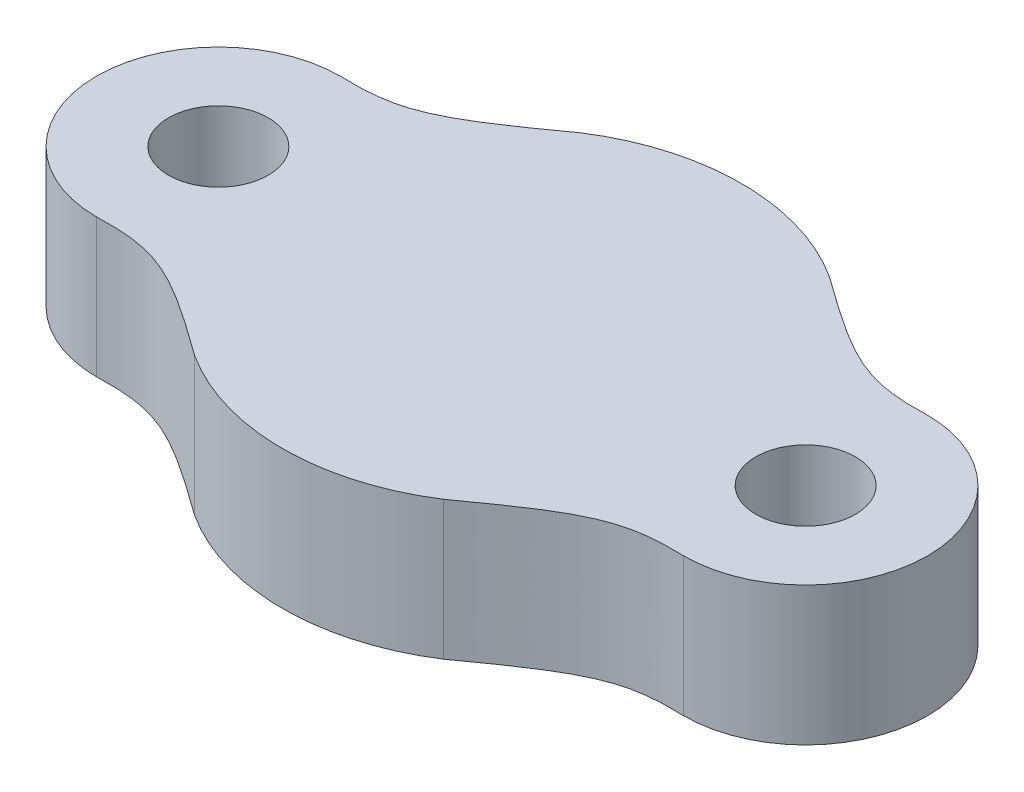
ISO-10303-21;
HEADER;
FILE_DESCRIPTION(('STEP AP214'),'2;1');
FILE_NAME('part.step','',(''),(''),'','','');
FILE_SCHEMA(('AUTOMOTIVE_DESIGN { 1 0 10303 214 1 1 1 1 }'));
ENDSEC;
DATA;
#1=APPLICATION_CONTEXT('core data for automotive mechanical design processes');
#2=APPLICATION_PROTOCOL_DEFINITION('international standard','automotive_design',2000,#1);
#3=PRODUCT_CONTEXT('',#1,'mechanical');
#4=PRODUCT('Part','Part','',(#3));
#5=PRODUCT_RELATED_PRODUCT_CATEGORY('part','',(#4));
#6=PRODUCT_DEFINITION_FORMATION('','',#4);
#7=PRODUCT_DEFINITION_CONTEXT('part definition',#1,'design');
#8=PRODUCT_DEFINITION('design','',#6,#7);
#9=PRODUCT_DEFINITION_SHAPE('','',#8);
#10=(LENGTH_UNIT() NAMED_UNIT(*) SI_UNIT(.MILLI.,.METRE.));
#11=(NAMED_UNIT(*) PLANE_ANGLE_UNIT() SI_UNIT($,.RADIAN.));
#12=(NAMED_UNIT(*) SI_UNIT($,.STERADIAN.) SOLID_ANGLE_UNIT());
#13=UNCERTAINTY_MEASURE_WITH_UNIT(LENGTH_MEASURE(1.E-05),#10,'distance_accuracy_value','');
#14=(GEOMETRIC_REPRESENTATION_CONTEXT(3) GLOBAL_UNCERTAINTY_ASSIGNED_CONTEXT((#13)) GLOBAL_UNIT_ASSIGNED_CONTEXT((#10,
#11,#12)) REPRESENTATION_CONTEXT('',''));
#15=CARTESIAN_POINT('',(0.,0.,0.));
#16=DIRECTION('',(0.,0.,1.));
#17=DIRECTION('',(1.,0.,0.));
#18=AXIS2_PLACEMENT_3D('',#15,#16,#17);
#19=CARTESIAN_POINT('',(-3.38919999851041,3.175,-1.4762849629327));
#20=DIRECTION('',(0.,-1.,0.));
#21=DIRECTION('',(0.,0.,-1.));
#22=AXIS2_PLACEMENT_3D('',#19,#20,#21);
#23=CYLINDRICAL_SURFACE('',#22,2.794);
#24=CARTESIAN_POINT('',(-3.38919999851041,0.,-1.4762849629327));
#25=DIRECTION('',(0.,1.,0.));
#26=DIRECTION('',(0.,0.,1.));
#27=AXIS2_PLACEMENT_3D('',#24,#25,#26);
#28=CIRCLE('',#27,2.794);
#29=CARTESIAN_POINT('',(-3.38919999851041,0.,-4.27028496293271));
#30=VERTEX_POINT('',#29);
#31=CARTESIAN_POINT('',(-3.38919999851041,0.,1.3177150370673));
#32=VERTEX_POINT('',#31);
#33=EDGE_CURVE('E204',#30,#32,#28,.F.);
#34=ORIENTED_EDGE('',*,*,#33,.F.);
#35=DIRECTION('',(0.,-1.,0.));
#36=VECTOR('',#35,1.);
#37=CARTESIAN_POINT('',(-3.38919999851041,3.175,-4.27028496293271));
#38=LINE('',#37,#36);
#39=CARTESIAN_POINT('',(-3.38919999851041,3.175,-4.27028496293271));
#40=VERTEX_POINT('',#39);
#41=EDGE_CURVE('E11',#40,#30,#38,.T.);
#42=ORIENTED_EDGE('',*,*,#41,.F.);
#43=CARTESIAN_POINT('',(-3.38919999851041,3.175,-1.4762849629327));
#44=DIRECTION('',(0.,1.,0.));
#45=DIRECTION('',(0.,0.,1.));
#46=AXIS2_PLACEMENT_3D('',#43,#44,#45);
#47=CIRCLE('',#46,2.794);
#48=CARTESIAN_POINT('',(-3.38919999851041,3.175,1.3177150370673));
#49=VERTEX_POINT('',#48);
#50=EDGE_CURVE('E141',#40,#49,#47,.F.);
#51=ORIENTED_EDGE('',*,*,#50,.T.);
#52=DIRECTION('',(0.,-1.,0.));
#53=VECTOR('',#52,1.);
#54=CARTESIAN_POINT('',(-3.38919999851041,3.175,1.3177150370673));
#55=LINE('',#54,#53);
#56=EDGE_CURVE('E55',#49,#32,#55,.T.);
#57=ORIENTED_EDGE('',*,*,#56,.T.);
#58=EDGE_LOOP('',(#34,#42,#51,#57));
#59=FACE_BOUND('',#58,.T.);
#60=ADVANCED_FACE('F39',(#59),#23,.T.);
#61=CARTESIAN_POINT('',(-3.38919999851041,3.175,-4.2702849629327));
#62=CARTESIAN_POINT('',(-4.78955958875303,3.175,-4.22149581850878));
#63=CARTESIAN_POINT('',(-5.3630765743595,3.175,-4.51950990375443));
#64=CARTESIAN_POINT('',(-7.2652862285684,3.175,-5.89707376315778));
#65=B_SPLINE_CURVE_WITH_KNOTS('',3,(#61,#62,#63,#64),.UNSPECIFIED.,.F.,.F.,(4,4),(0.,1.),.UNSPECIFIED.);
#66=DIRECTION('',(0.,-1.,0.));
#67=VECTOR('',#66,1.);
#68=SURFACE_OF_LINEAR_EXTRUSION('',#65,#67);
#69=CARTESIAN_POINT('',(-3.38919999851041,0.,-4.2702849629327));
#70=CARTESIAN_POINT('',(-4.78955958875303,0.,-4.22149581850878));
#71=CARTESIAN_POINT('',(-5.3630765743595,0.,-4.51950990375443));
#72=CARTESIAN_POINT('',(-7.2652862285684,0.,-5.89707376315778));
#73=B_SPLINE_CURVE_WITH_KNOTS('',3,(#69,#70,#71,#72),.UNSPECIFIED.,.F.,.F.,(4,4),(0.,1.),.UNSPECIFIED.);
#74=CARTESIAN_POINT('',(-7.2652862285684,0.,-5.89707376315778));
#75=VERTEX_POINT('',#74);
#76=EDGE_CURVE('E207',#30,#75,#73,.T.);
#77=ORIENTED_EDGE('',*,*,#76,.T.);
#78=DIRECTION('',(0.,-1.,0.));
#79=VECTOR('',#78,1.);
#80=CARTESIAN_POINT('',(-7.2652862285684,3.175,-5.89707376315778));
#81=LINE('',#80,#79);
#82=CARTESIAN_POINT('',(-7.2652862285684,3.175,-5.89707376315778));
#83=VERTEX_POINT('',#82);
#84=EDGE_CURVE('E47',#83,#75,#81,.T.);
#85=ORIENTED_EDGE('',*,*,#84,.F.);
#86=EDGE_CURVE('E137',#40,#83,#65,.T.);
#87=ORIENTED_EDGE('',*,*,#86,.F.);
#88=ORIENTED_EDGE('',*,*,#41,.T.);
#89=EDGE_LOOP('',(#77,#85,#87,#88));
#90=FACE_BOUND('',#89,.T.);
#91=ADVANCED_FACE('F151',(#90),#68,.F.);
#92=CARTESIAN_POINT('',(-10.1201999985104,3.175,-1.4762849629327));
#93=DIRECTION('',(0.,-1.,0.));
#94=DIRECTION('',(0.,0.,-1.));
#95=AXIS2_PLACEMENT_3D('',#92,#93,#94);
#96=CYLINDRICAL_SURFACE('',#95,5.2625);
#97=CARTESIAN_POINT('',(-10.1201999985104,0.,-1.4762849629327));
#98=DIRECTION('',(0.,1.,0.));
#99=DIRECTION('',(0.,0.,1.));
#100=AXIS2_PLACEMENT_3D('',#97,#98,#99);
#101=CIRCLE('',#100,5.2625);
#102=CARTESIAN_POINT('',(-12.9751137684524,0.,-5.89707376315778));
#103=VERTEX_POINT('',#102);
#104=EDGE_CURVE('E209',#75,#103,#101,.T.);
#105=ORIENTED_EDGE('',*,*,#104,.T.);
#106=DIRECTION('',(0.,-1.,0.));
#107=VECTOR('',#106,1.);
#108=CARTESIAN_POINT('',(-12.9751137684524,3.175,-5.89707376315778));
#109=LINE('',#108,#107);
#110=CARTESIAN_POINT('',(-12.9751137684524,3.175,-5.89707376315778));
#111=VERTEX_POINT('',#110);
#112=EDGE_CURVE('E256',#111,#103,#109,.T.);
#113=ORIENTED_EDGE('',*,*,#112,.F.);
#114=CARTESIAN_POINT('',(-10.1201999985104,3.175,-1.4762849629327));
#115=DIRECTION('',(0.,1.,0.));
#116=DIRECTION('',(0.,0.,1.));
#117=AXIS2_PLACEMENT_3D('',#114,#115,#116);
#118=CIRCLE('',#117,5.2625);
#119=EDGE_CURVE('E131',#83,#111,#118,.T.);
#120=ORIENTED_EDGE('',*,*,#119,.F.);
#121=ORIENTED_EDGE('',*,*,#84,.T.);
#122=EDGE_LOOP('',(#105,#113,#120,#121));
#123=FACE_BOUND('',#122,.T.);
#124=ADVANCED_FACE('F154',(#123),#96,.T.);
#125=CARTESIAN_POINT('',(-16.8511999985104,3.175,-4.2702849629327));
#126=CARTESIAN_POINT('',(-15.4508404082678,3.175,-4.22149581850878));
#127=CARTESIAN_POINT('',(-14.8773234226613,3.175,-4.51950990375443));
#128=CARTESIAN_POINT('',(-12.9751137684524,3.175,-5.89707376315778));
#129=B_SPLINE_CURVE_WITH_KNOTS('',3,(#125,#126,#127,#128),.UNSPECIFIED.,.F.,.F.,(4,4),(0.,1.),.UNSPECIFIED.);
#130=DIRECTION('',(0.,-1.,0.));
#131=VECTOR('',#130,1.);
#132=SURFACE_OF_LINEAR_EXTRUSION('',#129,#131);
#133=CARTESIAN_POINT('',(-16.8511999985104,0.,-4.2702849629327));
#134=CARTESIAN_POINT('',(-15.4508404082678,0.,-4.22149581850878));
#135=CARTESIAN_POINT('',(-14.8773234226613,0.,-4.51950990375443));
#136=CARTESIAN_POINT('',(-12.9751137684524,0.,-5.89707376315778));
#137=B_SPLINE_CURVE_WITH_KNOTS('',3,(#133,#134,#135,#136),.UNSPECIFIED.,.F.,.F.,(4,4),(0.,1.),.UNSPECIFIED.);
#138=CARTESIAN_POINT('',(-16.8511999985104,0.,-4.2702849629327));
#139=VERTEX_POINT('',#138);
#140=EDGE_CURVE('E221',#139,#103,#137,.T.);
#141=ORIENTED_EDGE('',*,*,#140,.F.);
#142=DIRECTION('',(0.,-1.,0.));
#143=VECTOR('',#142,1.);
#144=CARTESIAN_POINT('',(-16.8511999985104,3.175,-4.2702849629327));
#145=LINE('',#144,#143);
#146=CARTESIAN_POINT('',(-16.8511999985104,3.175,-4.2702849629327));
#147=VERTEX_POINT('',#146);
#148=EDGE_CURVE('E254',#147,#139,#145,.T.);
#149=ORIENTED_EDGE('',*,*,#148,.F.);
#150=EDGE_CURVE('E136',#147,#111,#129,.T.);
#151=ORIENTED_EDGE('',*,*,#150,.T.);
#152=ORIENTED_EDGE('',*,*,#112,.T.);
#153=EDGE_LOOP('',(#141,#149,#151,#152));
#154=FACE_BOUND('',#153,.T.);
#155=ADVANCED_FACE('F156',(#154),#132,.T.);
#156=CARTESIAN_POINT('',(-16.8511999985104,3.175,-1.4762849629327));
#157=DIRECTION('',(0.,-1.,0.));
#158=DIRECTION('',(0.,0.,-1.));
#159=AXIS2_PLACEMENT_3D('',#156,#157,#158);
#160=CYLINDRICAL_SURFACE('',#159,2.794);
#161=CARTESIAN_POINT('',(-16.8511999985104,0.,-1.4762849629327));
#162=DIRECTION('',(0.,1.,0.));
#163=DIRECTION('',(0.,0.,1.));
#164=AXIS2_PLACEMENT_3D('',#161,#162,#163);
#165=CIRCLE('',#164,2.794);
#166=CARTESIAN_POINT('',(-16.8511999985104,0.,1.31771503706729));
#167=VERTEX_POINT('',#166);
#168=EDGE_CURVE('E227',#167,#139,#165,.F.);
#169=ORIENTED_EDGE('',*,*,#168,.F.);
#170=DIRECTION('',(0.,-1.,0.));
#171=VECTOR('',#170,1.);
#172=CARTESIAN_POINT('',(-16.8511999985104,3.175,1.31771503706729));
#173=LINE('',#172,#171);
#174=CARTESIAN_POINT('',(-16.8511999985104,3.175,1.31771503706729));
#175=VERTEX_POINT('',#174);
#176=EDGE_CURVE('E126',#175,#167,#173,.T.);
#177=ORIENTED_EDGE('',*,*,#176,.F.);
#178=CARTESIAN_POINT('',(-16.8511999985104,3.175,-1.4762849629327));
#179=DIRECTION('',(0.,1.,0.));
#180=DIRECTION('',(0.,0.,1.));
#181=AXIS2_PLACEMENT_3D('',#178,#179,#180);
#182=CIRCLE('',#181,2.794);
#183=EDGE_CURVE('E116',#175,#147,#182,.F.);
#184=ORIENTED_EDGE('',*,*,#183,.T.);
#185=ORIENTED_EDGE('',*,*,#148,.T.);
#186=EDGE_LOOP('',(#169,#177,#184,#185));
#187=FACE_BOUND('',#186,.T.);
#188=ADVANCED_FACE('F159',(#187),#160,.T.);
#189=CARTESIAN_POINT('',(-16.8511999985104,3.175,1.31771503706729));
#190=CARTESIAN_POINT('',(-15.4508404082678,3.175,1.26892589264337));
#191=CARTESIAN_POINT('',(-14.8773234226613,3.175,1.56693997788902));
#192=CARTESIAN_POINT('',(-12.9751137684524,3.175,2.94450383729237));
#193=B_SPLINE_CURVE_WITH_KNOTS('',3,(#189,#190,#191,#192),.UNSPECIFIED.,.F.,.F.,(4,4),(0.,1.),.UNSPECIFIED.);
#194=DIRECTION('',(0.,-1.,0.));
#195=VECTOR('',#194,1.);
#196=SURFACE_OF_LINEAR_EXTRUSION('',#193,#195);
#197=CARTESIAN_POINT('',(-16.8511999985104,0.,1.31771503706729));
#198=CARTESIAN_POINT('',(-15.4508404082678,0.,1.26892589264337));
#199=CARTESIAN_POINT('',(-14.8773234226613,0.,1.56693997788902));
#200=CARTESIAN_POINT('',(-12.9751137684524,0.,2.94450383729237));
#201=B_SPLINE_CURVE_WITH_KNOTS('',3,(#197,#198,#199,#200),.UNSPECIFIED.,.F.,.F.,(4,4),(0.,1.),.UNSPECIFIED.);
#202=CARTESIAN_POINT('',(-12.9751137684524,0.,2.94450383729238));
#203=VERTEX_POINT('',#202);
#204=EDGE_CURVE('E123',#167,#203,#201,.T.);
#205=ORIENTED_EDGE('',*,*,#204,.T.);
#206=DIRECTION('',(0.,-1.,0.));
#207=VECTOR('',#206,1.);
#208=CARTESIAN_POINT('',(-12.9751137684524,3.175,2.94450383729238));
#209=LINE('',#208,#207);
#210=CARTESIAN_POINT('',(-12.9751137684524,3.175,2.94450383729238));
#211=VERTEX_POINT('',#210);
#212=EDGE_CURVE('E120',#211,#203,#209,.T.);
#213=ORIENTED_EDGE('',*,*,#212,.F.);
#214=EDGE_CURVE('E106',#175,#211,#193,.T.);
#215=ORIENTED_EDGE('',*,*,#214,.F.);
#216=ORIENTED_EDGE('',*,*,#176,.T.);
#217=EDGE_LOOP('',(#205,#213,#215,#216));
#218=FACE_BOUND('',#217,.T.);
#219=ADVANCED_FACE('F121',(#218),#196,.F.);
#220=CARTESIAN_POINT('',(-7.2652862285684,0.,2.94450383729237));
#221=VERTEX_POINT('',#220);
#222=EDGE_CURVE('E222',#203,#221,#101,.T.);
#223=ORIENTED_EDGE('',*,*,#222,.T.);
#224=DIRECTION('',(0.,-1.,0.));
#225=VECTOR('',#224,1.);
#226=CARTESIAN_POINT('',(-7.2652862285684,3.175,2.94450383729237));
#227=LINE('',#226,#225);
#228=CARTESIAN_POINT('',(-7.2652862285684,3.175,2.94450383729237));
#229=VERTEX_POINT('',#228);
#230=EDGE_CURVE('E81',#229,#221,#227,.T.);
#231=ORIENTED_EDGE('',*,*,#230,.F.);
#232=EDGE_CURVE('E113',#211,#229,#118,.T.);
#233=ORIENTED_EDGE('',*,*,#232,.F.);
#234=ORIENTED_EDGE('',*,*,#212,.T.);
#235=EDGE_LOOP('',(#223,#231,#233,#234));
#236=FACE_BOUND('',#235,.T.);
#237=ADVANCED_FACE('F128',(#236),#96,.T.);
#238=CARTESIAN_POINT('',(-3.38919999851041,3.175,-1.4762849629327));
#239=DIRECTION('',(0.,-1.,0.));
#240=DIRECTION('',(0.,0.,-1.));
#241=AXIS2_PLACEMENT_3D('',#238,#239,#240);
#242=CYLINDRICAL_SURFACE('',#241,1.143);
#243=CARTESIAN_POINT('',(-3.38919999851041,3.175,-1.4762849629327));
#244=DIRECTION('',(0.,1.,0.));
#245=DIRECTION('',(0.,0.,1.));
#246=AXIS2_PLACEMENT_3D('',#243,#244,#245);
#247=CIRCLE('',#246,1.143);
#248=CARTESIAN_POINT('',(-3.38919999851041,3.175,-0.333284962932704));
#249=VERTEX_POINT('',#248);
#250=EDGE_CURVE('E132',#249,#249,#247,.F.);
#251=ORIENTED_EDGE('',*,*,#250,.F.);
#252=EDGE_LOOP('',(#251));
#253=FACE_BOUND('',#252,.T.);
#254=CARTESIAN_POINT('',(-3.38919999851041,0.,-1.4762849629327));
#255=DIRECTION('',(0.,1.,0.));
#256=DIRECTION('',(0.,0.,1.));
#257=AXIS2_PLACEMENT_3D('',#254,#255,#256);
#258=CIRCLE('',#257,1.143);
#259=CARTESIAN_POINT('',(-3.38919999851041,0.,-0.333284962932704));
#260=VERTEX_POINT('',#259);
#261=EDGE_CURVE('E243',#260,#260,#258,.F.);
#262=ORIENTED_EDGE('',*,*,#261,.T.);
#263=EDGE_LOOP('',(#262));
#264=FACE_BOUND('',#263,.T.);
#265=ADVANCED_FACE('F183',(#253,#264),#242,.F.);
#266=CARTESIAN_POINT('',(-3.38919999851041,3.175,1.31771503706729));
#267=CARTESIAN_POINT('',(-4.78955958875303,3.175,1.26892589264337));
#268=CARTESIAN_POINT('',(-5.3630765743595,3.175,1.56693997788902));
#269=CARTESIAN_POINT('',(-7.2652862285684,3.175,2.94450383729238));
#270=B_SPLINE_CURVE_WITH_KNOTS('',3,(#266,#267,#268,#269),.UNSPECIFIED.,.F.,.F.,(4,4),(0.,1.),.UNSPECIFIED.);
#271=DIRECTION('',(0.,-1.,0.));
#272=VECTOR('',#271,1.);
#273=SURFACE_OF_LINEAR_EXTRUSION('',#270,#272);
#274=CARTESIAN_POINT('',(-3.38919999851041,0.,1.31771503706729));
#275=CARTESIAN_POINT('',(-4.78955958875303,0.,1.26892589264337));
#276=CARTESIAN_POINT('',(-5.3630765743595,0.,1.56693997788902));
#277=CARTESIAN_POINT('',(-7.2652862285684,0.,2.94450383729238));
#278=B_SPLINE_CURVE_WITH_KNOTS('',3,(#274,#275,#276,#277),.UNSPECIFIED.,.F.,.F.,(4,4),(0.,1.),.UNSPECIFIED.);
#279=EDGE_CURVE('E236',#32,#221,#278,.T.);
#280=ORIENTED_EDGE('',*,*,#279,.F.);
#281=ORIENTED_EDGE('',*,*,#56,.F.);
#282=EDGE_CURVE('E129',#49,#229,#270,.T.);
#283=ORIENTED_EDGE('',*,*,#282,.T.);
#284=ORIENTED_EDGE('',*,*,#230,.T.);
#285=EDGE_LOOP('',(#280,#281,#283,#284));
#286=FACE_BOUND('',#285,.T.);
#287=ADVANCED_FACE('F184',(#286),#273,.T.);
#288=CARTESIAN_POINT('',(-16.8511999985104,3.175,-1.4762849629327));
#289=DIRECTION('',(0.,-1.,0.));
#290=DIRECTION('',(0.,0.,-1.));
#291=AXIS2_PLACEMENT_3D('',#288,#289,#290);
#292=CYLINDRICAL_SURFACE('',#291,1.143);
#293=CARTESIAN_POINT('',(-16.8511999985104,3.175,-1.4762849629327));
#294=DIRECTION('',(0.,1.,0.));
#295=DIRECTION('',(0.,0.,1.));
#296=AXIS2_PLACEMENT_3D('',#293,#294,#295);
#297=CIRCLE('',#296,1.143);
#298=CARTESIAN_POINT('',(-16.8511999985104,3.175,-0.333284962932705));
#299=VERTEX_POINT('',#298);
#300=EDGE_CURVE('E212',#299,#299,#297,.F.);
#301=ORIENTED_EDGE('',*,*,#300,.F.);
#302=EDGE_LOOP('',(#301));
#303=FACE_BOUND('',#302,.T.);
#304=CARTESIAN_POINT('',(-16.8511999985104,0.,-1.4762849629327));
#305=DIRECTION('',(0.,1.,0.));
#306=DIRECTION('',(0.,0.,1.));
#307=AXIS2_PLACEMENT_3D('',#304,#305,#306);
#308=CIRCLE('',#307,1.143);
#309=CARTESIAN_POINT('',(-16.8511999985104,0.,-0.333284962932705));
#310=VERTEX_POINT('',#309);
#311=EDGE_CURVE('E143',#310,#310,#308,.F.);
#312=ORIENTED_EDGE('',*,*,#311,.T.);
#313=EDGE_LOOP('',(#312));
#314=FACE_BOUND('',#313,.T.);
#315=ADVANCED_FACE('F187',(#303,#314),#292,.F.);
#316=CARTESIAN_POINT('',(0.,3.175,0.));
#317=DIRECTION('',(0.,1.,0.));
#318=DIRECTION('',(0.,0.,1.));
#319=AXIS2_PLACEMENT_3D('',#316,#317,#318);
#320=PLANE('',#319);
#321=ORIENTED_EDGE('',*,*,#50,.F.);
#322=ORIENTED_EDGE('',*,*,#86,.T.);
#323=ORIENTED_EDGE('',*,*,#119,.T.);
#324=ORIENTED_EDGE('',*,*,#150,.F.);
#325=ORIENTED_EDGE('',*,*,#183,.F.);
#326=ORIENTED_EDGE('',*,*,#214,.T.);
#327=ORIENTED_EDGE('',*,*,#232,.T.);
#328=ORIENTED_EDGE('',*,*,#282,.F.);
#329=EDGE_LOOP('',(#321,#322,#323,#324,#325,#326,#327,#328));
#330=FACE_BOUND('',#329,.T.);
#331=ORIENTED_EDGE('',*,*,#250,.T.);
#332=EDGE_LOOP('',(#331));
#333=FACE_BOUND('',#332,.T.);
#334=ORIENTED_EDGE('',*,*,#300,.T.);
#335=EDGE_LOOP('',(#334));
#336=FACE_BOUND('',#335,.T.);
#337=ADVANCED_FACE('F109',(#330,#333,#336),#320,.T.);
#338=CARTESIAN_POINT('',(0.,0.,0.));
#339=DIRECTION('',(0.,1.,0.));
#340=DIRECTION('',(0.,0.,1.));
#341=AXIS2_PLACEMENT_3D('',#338,#339,#340);
#342=PLANE('',#341);
#343=ORIENTED_EDGE('',*,*,#33,.T.);
#344=ORIENTED_EDGE('',*,*,#279,.T.);
#345=ORIENTED_EDGE('',*,*,#222,.F.);
#346=ORIENTED_EDGE('',*,*,#204,.F.);
#347=ORIENTED_EDGE('',*,*,#168,.T.);
#348=ORIENTED_EDGE('',*,*,#140,.T.);
#349=ORIENTED_EDGE('',*,*,#104,.F.);
#350=ORIENTED_EDGE('',*,*,#76,.F.);
#351=EDGE_LOOP('',(#343,#344,#345,#346,#347,#348,#349,#350));
#352=FACE_BOUND('',#351,.T.);
#353=ORIENTED_EDGE('',*,*,#261,.F.);
#354=EDGE_LOOP('',(#353));
#355=FACE_BOUND('',#354,.T.);
#356=ORIENTED_EDGE('',*,*,#311,.F.);
#357=EDGE_LOOP('',(#356));
#358=FACE_BOUND('',#357,.T.);
#359=ADVANCED_FACE('F194',(#352,#355,#358),#342,.F.);
#360=CLOSED_SHELL('',(#60,#91,#124,#155,#188,#219,#237,#265,#287,#315,#337,#359));
#361=MANIFOLD_SOLID_BREP('B2',#360);
#362=ADVANCED_BREP_SHAPE_REPRESENTATION('',(#18,#361),#14);
#363=SHAPE_DEFINITION_REPRESENTATION(#9,#362);
ENDSEC;
END-ISO-10303-21;
